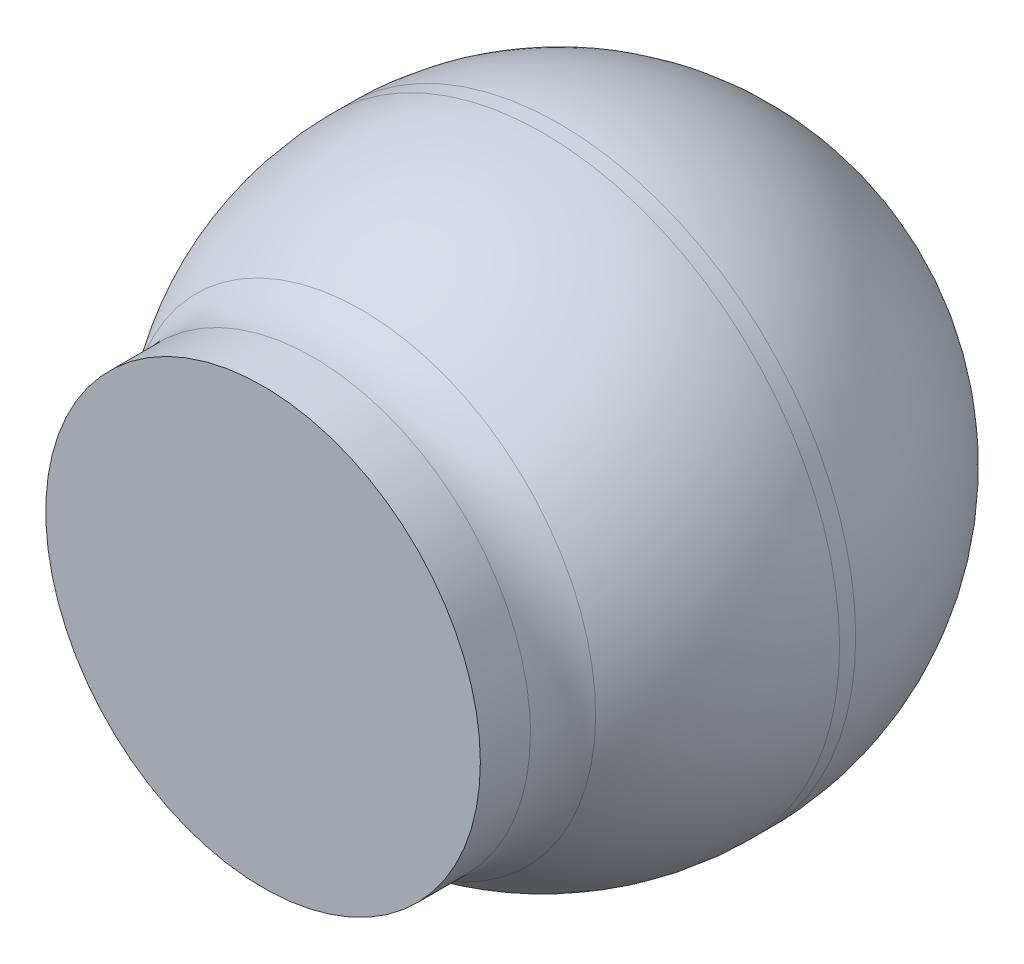
ISO-10303-21;
HEADER;
FILE_DESCRIPTION(('STEP AP214'),'2;1');
FILE_NAME('part.step','',(''),(''),'','','');
FILE_SCHEMA(('AUTOMOTIVE_DESIGN { 1 0 10303 214 1 1 1 1 }'));
ENDSEC;
DATA;
#1=APPLICATION_CONTEXT('core data for automotive mechanical design processes');
#2=APPLICATION_PROTOCOL_DEFINITION('international standard','automotive_design',2000,#1);
#3=PRODUCT_CONTEXT('',#1,'mechanical');
#4=PRODUCT('Part','Part','',(#3));
#5=PRODUCT_RELATED_PRODUCT_CATEGORY('part','',(#4));
#6=PRODUCT_DEFINITION_FORMATION('','',#4);
#7=PRODUCT_DEFINITION_CONTEXT('part definition',#1,'design');
#8=PRODUCT_DEFINITION('design','',#6,#7);
#9=PRODUCT_DEFINITION_SHAPE('','',#8);
#10=(LENGTH_UNIT() NAMED_UNIT(*) SI_UNIT(.MILLI.,.METRE.));
#11=(NAMED_UNIT(*) PLANE_ANGLE_UNIT() SI_UNIT($,.RADIAN.));
#12=(NAMED_UNIT(*) SI_UNIT($,.STERADIAN.) SOLID_ANGLE_UNIT());
#13=UNCERTAINTY_MEASURE_WITH_UNIT(LENGTH_MEASURE(1.E-05),#10,'distance_accuracy_value','');
#14=(GEOMETRIC_REPRESENTATION_CONTEXT(3) GLOBAL_UNCERTAINTY_ASSIGNED_CONTEXT((#13)) GLOBAL_UNIT_ASSIGNED_CONTEXT((#10,
#11,#12)) REPRESENTATION_CONTEXT('',''));
#15=CARTESIAN_POINT('',(0.,0.,0.));
#16=DIRECTION('',(0.,0.,1.));
#17=DIRECTION('',(1.,0.,0.));
#18=AXIS2_PLACEMENT_3D('',#15,#16,#17);
#19=CARTESIAN_POINT('',(-1.832919922269,-10.40134929145,10.006534503384));
#20=DIRECTION('',(0.,0.,-1.));
#21=DIRECTION('',(-1.,0.,0.));
#22=AXIS2_PLACEMENT_3D('',#19,#20,#21);
#23=PLANE('',#22);
#24=CARTESIAN_POINT('',(-1.832919922269,-10.40134929145,10.006534503384));
#25=DIRECTION('',(0.,0.,1.));
#26=DIRECTION('',(1.,0.,0.));
#27=AXIS2_PLACEMENT_3D('',#24,#25,#26);
#28=CIRCLE('',#27,0.275);
#29=CARTESIAN_POINT('',(-1.557919922269,-10.40134929145,10.006534503384));
#30=VERTEX_POINT('',#29);
#31=EDGE_CURVE('E20',#30,#30,#28,.F.);
#32=ORIENTED_EDGE('',*,*,#31,.F.);
#33=EDGE_LOOP('',(#32));
#34=FACE_BOUND('',#33,.T.);
#35=ADVANCED_FACE('F17',(#34),#23,.F.);
#36=CARTESIAN_POINT('',(-1.832919922269,-10.40134929145,9.906534503384));
#37=DIRECTION('',(0.,0.,1.));
#38=DIRECTION('',(1.,0.,0.));
#39=AXIS2_PLACEMENT_3D('',#36,#37,#38);
#40=CYLINDRICAL_SURFACE('',#39,0.275);
#41=CARTESIAN_POINT('',(-1.832919922269,-10.40134929145,9.943180457728));
#42=DIRECTION('',(0.,0.,-1.));
#43=DIRECTION('',(0.996700902337582,0.0811622527992469,0.));
#44=AXIS2_PLACEMENT_3D('',#41,#42,#43);
#45=CIRCLE('',#44,0.275);
#46=CARTESIAN_POINT('',(-1.55882717412616,-10.3790296719302,9.943180457728));
#47=VERTEX_POINT('',#46);
#48=EDGE_CURVE('E66',#47,#47,#45,.F.);
#49=ORIENTED_EDGE('',*,*,#48,.T.);
#50=EDGE_LOOP('',(#49));
#51=FACE_BOUND('',#50,.T.);
#52=ORIENTED_EDGE('',*,*,#31,.T.);
#53=EDGE_LOOP('',(#52));
#54=FACE_BOUND('',#53,.T.);
#55=ADVANCED_FACE('F62',(#51,#54),#40,.T.);
#56=CARTESIAN_POINT('',(-1.832919922269,-10.40134929145,9.943180457728));
#57=DIRECTION('',(0.,0.,-1.));
#58=DIRECTION('',(0.996700902337583,0.0811622527992448,0.));
#59=AXIS2_PLACEMENT_3D('',#56,#57,#58);
#60=TOROIDAL_SURFACE('',#59,0.375,0.1);
#61=ORIENTED_EDGE('',*,*,#48,.F.);
#62=EDGE_LOOP('',(#61));
#63=FACE_BOUND('',#62,.T.);
#64=CARTESIAN_POINT('',(-1.832919922269,-10.40134929145,9.881744931236));
#65=DIRECTION('',(0.,0.,-1.));
#66=DIRECTION('',(-0.99670090233869,-0.0811622527856412,0.));
#67=AXIS2_PLACEMENT_3D('',#64,#65,#66);
#68=CIRCLE('',#67,0.29609704641234);
#69=CARTESIAN_POINT('',(-2.128040115608,-10.42538119478,9.881744931236));
#70=VERTEX_POINT('',#69);
#71=EDGE_CURVE('E39',#70,#70,#68,.T.);
#72=ORIENTED_EDGE('',*,*,#71,.F.);
#73=EDGE_LOOP('',(#72));
#74=FACE_BOUND('',#73,.T.);
#75=ADVANCED_FACE('F57',(#63,#74),#60,.F.);
#76=CARTESIAN_POINT('',(-2.206682760645,-10.43178513625,9.651976062157));
#77=CARTESIAN_POINT('',(-2.206682760645,-10.43178513625,9.701461392103));
#78=CARTESIAN_POINT('',(-2.198526217348,-10.43112094157,9.750947004335));
#79=CARTESIAN_POINT('',(-2.182207085349,-10.42979205995,9.798626332798));
#80=CARTESIAN_POINT('',(-2.158341390838,-10.42784865493,9.842699544317));
#81=CARTESIAN_POINT('',(-2.128040115608,-10.42538119478,9.881744931236));
#82=(BOUNDED_CURVE() B_SPLINE_CURVE(5,(#76,#77,#78,#79,#80,#81),.UNSPECIFIED.,.F.,
.F.) B_SPLINE_CURVE_WITH_KNOTS((6,6),(0.,0.661568582165),
.UNSPECIFIED.) CURVE() GEOMETRIC_REPRESENTATION_ITEM() RATIONAL_B_SPLINE_CURVE((1.,1.,1.,1.,1.,1.)) REPRESENTATION_ITEM(''));
#83=CARTESIAN_POINT('',(-1.832919922269,-10.40134929145,9.651976062157));
#84=DIRECTION('',(0.,0.,-1.));
#85=AXIS1_PLACEMENT('',#83,#84);
#86=SURFACE_OF_REVOLUTION('',#82,#85);
#87=CARTESIAN_POINT('',(-1.832919922269,-10.40134929145,9.651976062157));
#88=DIRECTION('',(0.,0.,1.));
#89=DIRECTION('',(1.,0.,0.));
#90=AXIS2_PLACEMENT_3D('',#87,#88,#89);
#91=CIRCLE('',#90,0.375);
#92=CARTESIAN_POINT('',(-1.457919922269,-10.40134929145,9.651976062157));
#93=VERTEX_POINT('',#92);
#94=EDGE_CURVE('E36',#93,#93,#91,.F.);
#95=ORIENTED_EDGE('',*,*,#94,.F.);
#96=EDGE_LOOP('',(#95));
#97=FACE_BOUND('',#96,.T.);
#98=ORIENTED_EDGE('',*,*,#71,.T.);
#99=EDGE_LOOP('',(#98));
#100=FACE_BOUND('',#99,.T.);
#101=ADVANCED_FACE('F53',(#97,#100),#86,.F.);
#102=CARTESIAN_POINT('',(-1.832919922269,-10.40134929145,9.256534503384));
#103=DIRECTION('',(0.,0.,1.));
#104=DIRECTION('',(1.,0.,0.));
#105=AXIS2_PLACEMENT_3D('',#102,#103,#104);
#106=CYLINDRICAL_SURFACE('',#105,0.375);
#107=CARTESIAN_POINT('',(-1.832919922269,-10.40134929145,9.631534503384));
#108=DIRECTION('',(0.,0.,-1.));
#109=DIRECTION('',(0.0811622527992362,-0.996700902337583,0.));
#110=AXIS2_PLACEMENT_3D('',#107,#108,#109);
#111=CIRCLE('',#110,0.375);
#112=CARTESIAN_POINT('',(-1.80248407746929,-10.7751121298266,9.631534503384));
#113=VERTEX_POINT('',#112);
#114=CARTESIAN_POINT('',(-1.86335576706871,-10.0275864530734,9.631534503384));
#115=VERTEX_POINT('',#114);
#116=EDGE_CURVE('E11',#113,#115,#111,.T.);
#117=ORIENTED_EDGE('',*,*,#116,.F.);
#118=CARTESIAN_POINT('',(-1.832919922269,-10.40134929145,9.631534503384));
#119=DIRECTION('',(3.33436315446763E-12,2.72100352061447E-13,1.));
#120=DIRECTION('',(0.0811622527992359,-0.996700902337583,0.));
#121=AXIS2_PLACEMENT_3D('',#118,#119,#120);
#122=CIRCLE('',#121,0.375);
#123=EDGE_CURVE('E25',#115,#113,#122,.F.);
#124=ORIENTED_EDGE('',*,*,#123,.F.);
#125=EDGE_LOOP('',(#117,#124));
#126=FACE_BOUND('',#125,.T.);
#127=ORIENTED_EDGE('',*,*,#94,.T.);
#128=EDGE_LOOP('',(#127));
#129=FACE_BOUND('',#128,.T.);
#130=ADVANCED_FACE('F34',(#126,#129),#106,.T.);
#131=CARTESIAN_POINT('',(-1.832919922269,-10.40134929145,9.631534503384));
#132=DIRECTION('',(0.0811622527992361,-0.996700902337583,0.));
#133=DIRECTION('',(-0.996700902337583,-0.0811622527992361,0.));
#134=AXIS2_PLACEMENT_3D('',#131,#132,#133);
#135=SPHERICAL_SURFACE('',#134,0.375);
#136=ORIENTED_EDGE('',*,*,#123,.T.);
#137=ORIENTED_EDGE('',*,*,#116,.T.);
#138=EDGE_LOOP('',(#136,#137));
#139=FACE_BOUND('',#138,.T.);
#140=ADVANCED_FACE('F32',(#139),#135,.T.);
#141=CLOSED_SHELL('',(#35,#55,#75,#101,#130,#140));
#142=MANIFOLD_SOLID_BREP('B1',#141);
#143=ADVANCED_BREP_SHAPE_REPRESENTATION('',(#18,#142),#14);
#144=SHAPE_DEFINITION_REPRESENTATION(#9,#143);
ENDSEC;
END-ISO-10303-21;
